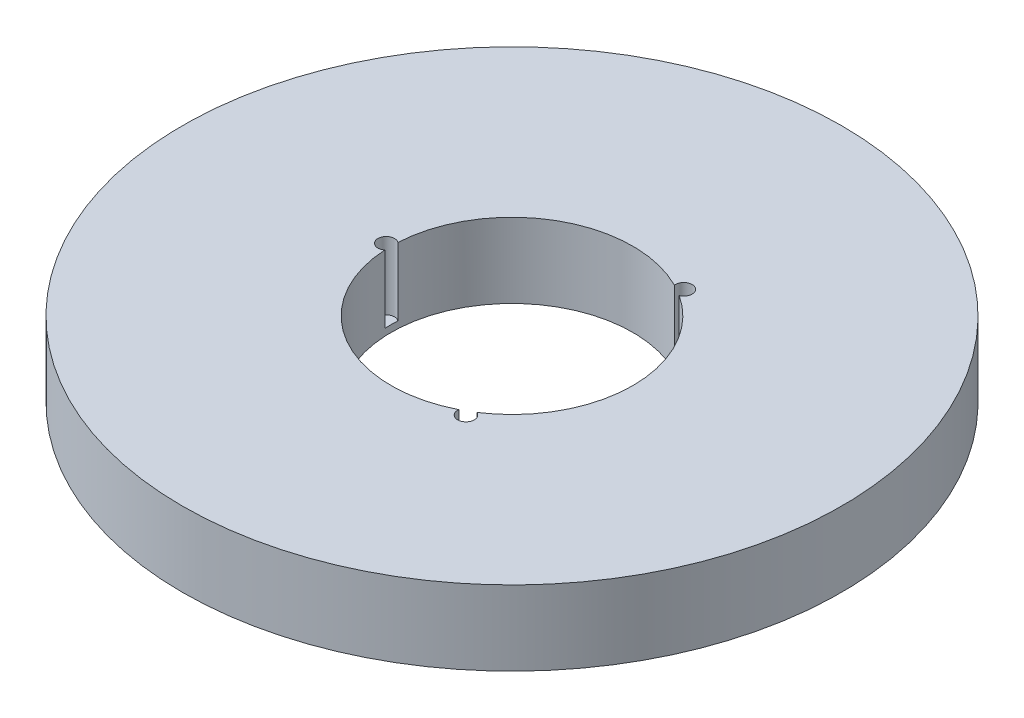
ISO-10303-21;
HEADER;
FILE_DESCRIPTION(('STEP AP214'),'2;1');
FILE_NAME('part.step','',(''),(''),'','','');
FILE_SCHEMA(('AUTOMOTIVE_DESIGN { 1 0 10303 214 1 1 1 1 }'));
ENDSEC;
DATA;
#1=APPLICATION_CONTEXT('core data for automotive mechanical design processes');
#2=APPLICATION_PROTOCOL_DEFINITION('international standard','automotive_design',2000,#1);
#3=PRODUCT_CONTEXT('',#1,'mechanical');
#4=PRODUCT('Part','Part','',(#3));
#5=PRODUCT_RELATED_PRODUCT_CATEGORY('part','',(#4));
#6=PRODUCT_DEFINITION_FORMATION('','',#4);
#7=PRODUCT_DEFINITION_CONTEXT('part definition',#1,'design');
#8=PRODUCT_DEFINITION('design','',#6,#7);
#9=PRODUCT_DEFINITION_SHAPE('','',#8);
#10=(LENGTH_UNIT() NAMED_UNIT(*) SI_UNIT(.MILLI.,.METRE.));
#11=(NAMED_UNIT(*) PLANE_ANGLE_UNIT() SI_UNIT($,.RADIAN.));
#12=(NAMED_UNIT(*) SI_UNIT($,.STERADIAN.) SOLID_ANGLE_UNIT());
#13=UNCERTAINTY_MEASURE_WITH_UNIT(LENGTH_MEASURE(1.E-05),#10,'distance_accuracy_value','');
#14=(GEOMETRIC_REPRESENTATION_CONTEXT(3) GLOBAL_UNCERTAINTY_ASSIGNED_CONTEXT((#13)) GLOBAL_UNIT_ASSIGNED_CONTEXT((#10,
#11,#12)) REPRESENTATION_CONTEXT('',''));
#15=CARTESIAN_POINT('',(0.,0.,0.));
#16=DIRECTION('',(0.,0.,1.));
#17=DIRECTION('',(1.,0.,0.));
#18=AXIS2_PLACEMENT_3D('',#15,#16,#17);
#19=CARTESIAN_POINT('',(0.,17.,0.));
#20=DIRECTION('',(0.,-1.,0.));
#21=DIRECTION('',(0.,0.,-1.));
#22=AXIS2_PLACEMENT_3D('',#19,#20,#21);
#23=CYLINDRICAL_SURFACE('',#22,75.);
#24=CARTESIAN_POINT('',(0.,17.,0.));
#25=DIRECTION('',(0.,1.,0.));
#26=DIRECTION('',(0.,0.,1.));
#27=AXIS2_PLACEMENT_3D('',#24,#25,#26);
#28=CIRCLE('',#27,75.);
#29=CARTESIAN_POINT('',(0.,17.,75.));
#30=VERTEX_POINT('',#29);
#31=EDGE_CURVE('E126',#30,#30,#28,.T.);
#32=ORIENTED_EDGE('',*,*,#31,.F.);
#33=EDGE_LOOP('',(#32));
#34=FACE_BOUND('',#33,.T.);
#35=CARTESIAN_POINT('',(0.,0.,0.));
#36=DIRECTION('',(0.,1.,0.));
#37=DIRECTION('',(0.,0.,1.));
#38=AXIS2_PLACEMENT_3D('',#35,#36,#37);
#39=CIRCLE('',#38,75.);
#40=CARTESIAN_POINT('',(0.,0.,75.));
#41=VERTEX_POINT('',#40);
#42=EDGE_CURVE('E124',#41,#41,#39,.T.);
#43=ORIENTED_EDGE('',*,*,#42,.T.);
#44=EDGE_LOOP('',(#43));
#45=FACE_BOUND('',#44,.T.);
#46=ADVANCED_FACE('F39',(#34,#45),#23,.T.);
#47=CARTESIAN_POINT('',(0.,17.,0.));
#48=DIRECTION('',(0.,1.,0.));
#49=DIRECTION('',(0.,0.,1.));
#50=AXIS2_PLACEMENT_3D('',#47,#48,#49);
#51=PLANE('',#50);
#52=CARTESIAN_POINT('',(14.310679317804,17.,24.7868236692613));
#53=DIRECTION('',(0.,1.,0.));
#54=DIRECTION('',(0.866025403784436,0.,-0.500000000000004));
#55=AXIS2_PLACEMENT_3D('',#52,#53,#54);
#56=CIRCLE('',#55,1.89538136985089);
#57=CARTESIAN_POINT('',(12.4329130265206,17.,24.5290169732701));
#58=VERTEX_POINT('',#57);
#59=CARTESIAN_POINT('',(15.0262953154515,17.,23.0317270106443));
#60=VERTEX_POINT('',#59);
#61=EDGE_CURVE('E147',#58,#60,#56,.T.);
#62=ORIENTED_EDGE('',*,*,#61,.F.);
#63=CARTESIAN_POINT('',(0.,17.,0.));
#64=DIRECTION('',(0.,1.,0.));
#65=DIRECTION('',(0.,0.,1.));
#66=AXIS2_PLACEMENT_3D('',#63,#64,#65);
#67=CIRCLE('',#66,27.5);
#68=CARTESIAN_POINT('',(-27.4592083419719,17.,1.49728996262584));
#69=VERTEX_POINT('',#68);
#70=EDGE_CURVE('E118',#69,#58,#67,.T.);
#71=ORIENTED_EDGE('',*,*,#70,.F.);
#72=CARTESIAN_POINT('',(-28.6213586356077,17.,0.));
#73=DIRECTION('',(0.,1.,0.));
#74=DIRECTION('',(0.,0.,1.));
#75=AXIS2_PLACEMENT_3D('',#72,#73,#74);
#76=CIRCLE('',#75,1.89538136985089);
#77=CARTESIAN_POINT('',(-27.4592083419719,17.,-1.49728996262584));
#78=VERTEX_POINT('',#77);
#79=EDGE_CURVE('E113',#78,#69,#76,.T.);
#80=ORIENTED_EDGE('',*,*,#79,.F.);
#81=CARTESIAN_POINT('',(12.4329130265203,17.,-24.5290169732703));
#82=VERTEX_POINT('',#81);
#83=EDGE_CURVE('E106',#82,#78,#67,.T.);
#84=ORIENTED_EDGE('',*,*,#83,.F.);
#85=CARTESIAN_POINT('',(14.3106793178036,17.,-24.7868236692615));
#86=DIRECTION('',(0.,1.,0.));
#87=DIRECTION('',(-0.866025403784443,0.,-0.499999999999992));
#88=AXIS2_PLACEMENT_3D('',#85,#86,#87);
#89=CIRCLE('',#88,1.89538136985089);
#90=CARTESIAN_POINT('',(15.0262953154512,17.,-23.0317270106445));
#91=VERTEX_POINT('',#90);
#92=EDGE_CURVE('E90',#91,#82,#89,.T.);
#93=ORIENTED_EDGE('',*,*,#92,.F.);
#94=EDGE_CURVE('E116',#60,#91,#67,.T.);
#95=ORIENTED_EDGE('',*,*,#94,.F.);
#96=EDGE_LOOP('',(#62,#71,#80,#84,#93,#95));
#97=FACE_BOUND('',#96,.T.);
#98=ORIENTED_EDGE('',*,*,#31,.T.);
#99=EDGE_LOOP('',(#98));
#100=FACE_BOUND('',#99,.T.);
#101=ADVANCED_FACE('F115',(#97,#100),#51,.T.);
#102=CARTESIAN_POINT('',(0.,0.,0.));
#103=DIRECTION('',(0.,1.,0.));
#104=DIRECTION('',(0.,0.,1.));
#105=AXIS2_PLACEMENT_3D('',#102,#103,#104);
#106=PLANE('',#105);
#107=CARTESIAN_POINT('',(0.,0.,0.));
#108=DIRECTION('',(0.,1.,0.));
#109=DIRECTION('',(0.,0.,1.));
#110=AXIS2_PLACEMENT_3D('',#107,#108,#109);
#111=CIRCLE('',#110,27.5);
#112=CARTESIAN_POINT('',(0.,0.,27.5));
#113=VERTEX_POINT('',#112);
#114=EDGE_CURVE('E120',#113,#113,#111,.T.);
#115=ORIENTED_EDGE('',*,*,#114,.T.);
#116=EDGE_LOOP('',(#115));
#117=FACE_BOUND('',#116,.T.);
#118=ORIENTED_EDGE('',*,*,#42,.F.);
#119=EDGE_LOOP('',(#118));
#120=FACE_BOUND('',#119,.T.);
#121=ADVANCED_FACE('F164',(#117,#120),#106,.F.);
#122=CARTESIAN_POINT('',(0.,17.,0.));
#123=DIRECTION('',(0.,-1.,0.));
#124=DIRECTION('',(0.,0.,-1.));
#125=AXIS2_PLACEMENT_3D('',#122,#123,#124);
#126=CYLINDRICAL_SURFACE('',#125,27.5);
#127=DIRECTION('',(0.,1.,0.));
#128=VECTOR('',#127,1.);
#129=CARTESIAN_POINT('',(12.4329130265207,9.26884942540381,24.5290169732701));
#130=LINE('',#129,#128);
#131=CARTESIAN_POINT('',(12.4329130265206,1.53769885080762,24.5290169732701));
#132=VERTEX_POINT('',#131);
#133=EDGE_CURVE('E11',#132,#58,#130,.T.);
#134=ORIENTED_EDGE('',*,*,#133,.F.);
#135=CARTESIAN_POINT('',(0.,1.53769885080762,0.));
#136=DIRECTION('',(0.,1.,0.));
#137=DIRECTION('',(0.,0.,1.));
#138=AXIS2_PLACEMENT_3D('',#135,#136,#137);
#139=CIRCLE('',#138,27.5);
#140=CARTESIAN_POINT('',(15.0262953154515,1.53769885080762,23.0317270106443));
#141=VERTEX_POINT('',#140);
#142=EDGE_CURVE('E144',#132,#141,#139,.T.);
#143=ORIENTED_EDGE('',*,*,#142,.T.);
#144=DIRECTION('',(0.,1.,0.));
#145=VECTOR('',#144,1.);
#146=CARTESIAN_POINT('',(15.0262953154515,9.26884942540381,23.0317270106443));
#147=LINE('',#146,#145);
#148=EDGE_CURVE('E46',#60,#141,#147,.F.);
#149=ORIENTED_EDGE('',*,*,#148,.F.);
#150=ORIENTED_EDGE('',*,*,#94,.T.);
#151=DIRECTION('',(0.,1.,0.));
#152=VECTOR('',#151,1.);
#153=CARTESIAN_POINT('',(15.0262953154512,9.26884942540381,-23.0317270106445));
#154=LINE('',#153,#152);
#155=CARTESIAN_POINT('',(15.0262953154512,1.53769885080762,-23.0317270106445));
#156=VERTEX_POINT('',#155);
#157=EDGE_CURVE('E92',#156,#91,#154,.T.);
#158=ORIENTED_EDGE('',*,*,#157,.F.);
#159=CARTESIAN_POINT('',(0.,1.53769885080762,0.));
#160=DIRECTION('',(0.,1.,0.));
#161=DIRECTION('',(0.,0.,1.));
#162=AXIS2_PLACEMENT_3D('',#159,#160,#161);
#163=CIRCLE('',#162,27.5);
#164=CARTESIAN_POINT('',(12.4329130265203,1.53769885080762,-24.5290169732703));
#165=VERTEX_POINT('',#164);
#166=EDGE_CURVE('E107',#156,#165,#163,.T.);
#167=ORIENTED_EDGE('',*,*,#166,.T.);
#168=DIRECTION('',(0.,1.,0.));
#169=VECTOR('',#168,1.);
#170=CARTESIAN_POINT('',(12.4329130265203,9.26884942540381,-24.5290169732703));
#171=LINE('',#170,#169);
#172=EDGE_CURVE('E95',#82,#165,#171,.F.);
#173=ORIENTED_EDGE('',*,*,#172,.F.);
#174=ORIENTED_EDGE('',*,*,#83,.T.);
#175=DIRECTION('',(0.,1.,0.));
#176=VECTOR('',#175,1.);
#177=CARTESIAN_POINT('',(-27.4592083419719,9.26884942540381,-1.49728996262582));
#178=LINE('',#177,#176);
#179=CARTESIAN_POINT('',(-27.4592083419719,1.53769885080762,-1.49728996262584));
#180=VERTEX_POINT('',#179);
#181=EDGE_CURVE('E143',#180,#78,#178,.T.);
#182=ORIENTED_EDGE('',*,*,#181,.F.);
#183=CARTESIAN_POINT('',(0.,1.53769885080762,0.));
#184=DIRECTION('',(0.,1.,0.));
#185=DIRECTION('',(0.,0.,1.));
#186=AXIS2_PLACEMENT_3D('',#183,#184,#185);
#187=CIRCLE('',#186,27.5);
#188=CARTESIAN_POINT('',(-27.4592083419719,1.53769885080762,1.49728996262584));
#189=VERTEX_POINT('',#188);
#190=EDGE_CURVE('E132',#180,#189,#187,.T.);
#191=ORIENTED_EDGE('',*,*,#190,.T.);
#192=DIRECTION('',(0.,1.,0.));
#193=VECTOR('',#192,1.);
#194=CARTESIAN_POINT('',(-27.4592083419719,9.26884942540381,1.49728996262582));
#195=LINE('',#194,#193);
#196=EDGE_CURVE('E137',#69,#189,#195,.F.);
#197=ORIENTED_EDGE('',*,*,#196,.F.);
#198=ORIENTED_EDGE('',*,*,#70,.T.);
#199=EDGE_LOOP('',(#134,#143,#149,#150,#158,#167,#173,#174,#182,#191,#197,#198));
#200=FACE_BOUND('',#199,.T.);
#201=ORIENTED_EDGE('',*,*,#114,.F.);
#202=EDGE_LOOP('',(#201));
#203=FACE_BOUND('',#202,.T.);
#204=ADVANCED_FACE('F103',(#200,#203),#126,.F.);
#205=CARTESIAN_POINT('',(-28.6213586356077,1.53769885080762,0.));
#206=DIRECTION('',(0.,1.,0.));
#207=DIRECTION('',(0.,0.,1.));
#208=AXIS2_PLACEMENT_3D('',#205,#206,#207);
#209=CYLINDRICAL_SURFACE('',#208,1.89538136985089);
#210=ORIENTED_EDGE('',*,*,#181,.T.);
#211=ORIENTED_EDGE('',*,*,#79,.T.);
#212=ORIENTED_EDGE('',*,*,#196,.T.);
#213=CARTESIAN_POINT('',(-28.6213586356077,1.53769885080762,0.));
#214=DIRECTION('',(0.,1.,0.));
#215=DIRECTION('',(0.,0.,1.));
#216=AXIS2_PLACEMENT_3D('',#213,#214,#215);
#217=CIRCLE('',#216,1.89538136985089);
#218=EDGE_CURVE('E121',#180,#189,#217,.T.);
#219=ORIENTED_EDGE('',*,*,#218,.F.);
#220=EDGE_LOOP('',(#210,#211,#212,#219));
#221=FACE_BOUND('',#220,.T.);
#222=ADVANCED_FACE('F174',(#221),#209,.F.);
#223=CARTESIAN_POINT('',(-28.6213586356077,1.53769885080762,0.));
#224=DIRECTION('',(0.,1.,0.));
#225=DIRECTION('',(0.,0.,1.));
#226=AXIS2_PLACEMENT_3D('',#223,#224,#225);
#227=PLANE('',#226);
#228=ORIENTED_EDGE('',*,*,#218,.T.);
#229=ORIENTED_EDGE('',*,*,#190,.F.);
#230=EDGE_LOOP('',(#228,#229));
#231=FACE_BOUND('',#230,.T.);
#232=ADVANCED_FACE('F177',(#231),#227,.T.);
#233=CARTESIAN_POINT('',(14.3106793178036,1.53769885080762,-24.7868236692615));
#234=DIRECTION('',(0.,1.,0.));
#235=DIRECTION('',(0.,0.,1.));
#236=AXIS2_PLACEMENT_3D('',#233,#234,#235);
#237=CYLINDRICAL_SURFACE('',#236,1.89538136985089);
#238=ORIENTED_EDGE('',*,*,#157,.T.);
#239=ORIENTED_EDGE('',*,*,#92,.T.);
#240=ORIENTED_EDGE('',*,*,#172,.T.);
#241=CARTESIAN_POINT('',(14.3106793178036,1.53769885080762,-24.7868236692615));
#242=DIRECTION('',(0.,1.,0.));
#243=DIRECTION('',(-0.866025403784443,0.,-0.499999999999992));
#244=AXIS2_PLACEMENT_3D('',#241,#242,#243);
#245=CIRCLE('',#244,1.89538136985089);
#246=EDGE_CURVE('E56',#156,#165,#245,.T.);
#247=ORIENTED_EDGE('',*,*,#246,.F.);
#248=EDGE_LOOP('',(#238,#239,#240,#247));
#249=FACE_BOUND('',#248,.T.);
#250=ADVANCED_FACE('F93',(#249),#237,.F.);
#251=CARTESIAN_POINT('',(14.3106793178036,1.53769885080762,-24.7868236692615));
#252=DIRECTION('',(0.,1.,0.));
#253=DIRECTION('',(-0.866025403784443,0.,-0.499999999999992));
#254=AXIS2_PLACEMENT_3D('',#251,#252,#253);
#255=PLANE('',#254);
#256=ORIENTED_EDGE('',*,*,#246,.T.);
#257=ORIENTED_EDGE('',*,*,#166,.F.);
#258=EDGE_LOOP('',(#256,#257));
#259=FACE_BOUND('',#258,.T.);
#260=ADVANCED_FACE('F160',(#259),#255,.T.);
#261=CARTESIAN_POINT('',(14.310679317804,1.53769885080762,24.7868236692613));
#262=DIRECTION('',(0.,1.,0.));
#263=DIRECTION('',(0.,0.,1.));
#264=AXIS2_PLACEMENT_3D('',#261,#262,#263);
#265=CYLINDRICAL_SURFACE('',#264,1.89538136985089);
#266=ORIENTED_EDGE('',*,*,#133,.T.);
#267=ORIENTED_EDGE('',*,*,#61,.T.);
#268=ORIENTED_EDGE('',*,*,#148,.T.);
#269=CARTESIAN_POINT('',(14.310679317804,1.53769885080762,24.7868236692613));
#270=DIRECTION('',(0.,1.,0.));
#271=DIRECTION('',(0.866025403784436,0.,-0.500000000000004));
#272=AXIS2_PLACEMENT_3D('',#269,#270,#271);
#273=CIRCLE('',#272,1.89538136985089);
#274=EDGE_CURVE('E55',#132,#141,#273,.T.);
#275=ORIENTED_EDGE('',*,*,#274,.F.);
#276=EDGE_LOOP('',(#266,#267,#268,#275));
#277=FACE_BOUND('',#276,.T.);
#278=ADVANCED_FACE('F149',(#277),#265,.F.);
#279=CARTESIAN_POINT('',(14.310679317804,1.53769885080762,24.7868236692613));
#280=DIRECTION('',(0.,1.,0.));
#281=DIRECTION('',(0.866025403784436,0.,-0.500000000000004));
#282=AXIS2_PLACEMENT_3D('',#279,#280,#281);
#283=PLANE('',#282);
#284=ORIENTED_EDGE('',*,*,#274,.T.);
#285=ORIENTED_EDGE('',*,*,#142,.F.);
#286=EDGE_LOOP('',(#284,#285));
#287=FACE_BOUND('',#286,.T.);
#288=ADVANCED_FACE('F151',(#287),#283,.T.);
#289=CLOSED_SHELL('',(#46,#101,#121,#204,#222,#232,#250,#260,#278,#288));
#290=MANIFOLD_SOLID_BREP('B2',#289);
#291=ADVANCED_BREP_SHAPE_REPRESENTATION('',(#18,#290),#14);
#292=SHAPE_DEFINITION_REPRESENTATION(#9,#291);
ENDSEC;
END-ISO-10303-21;
